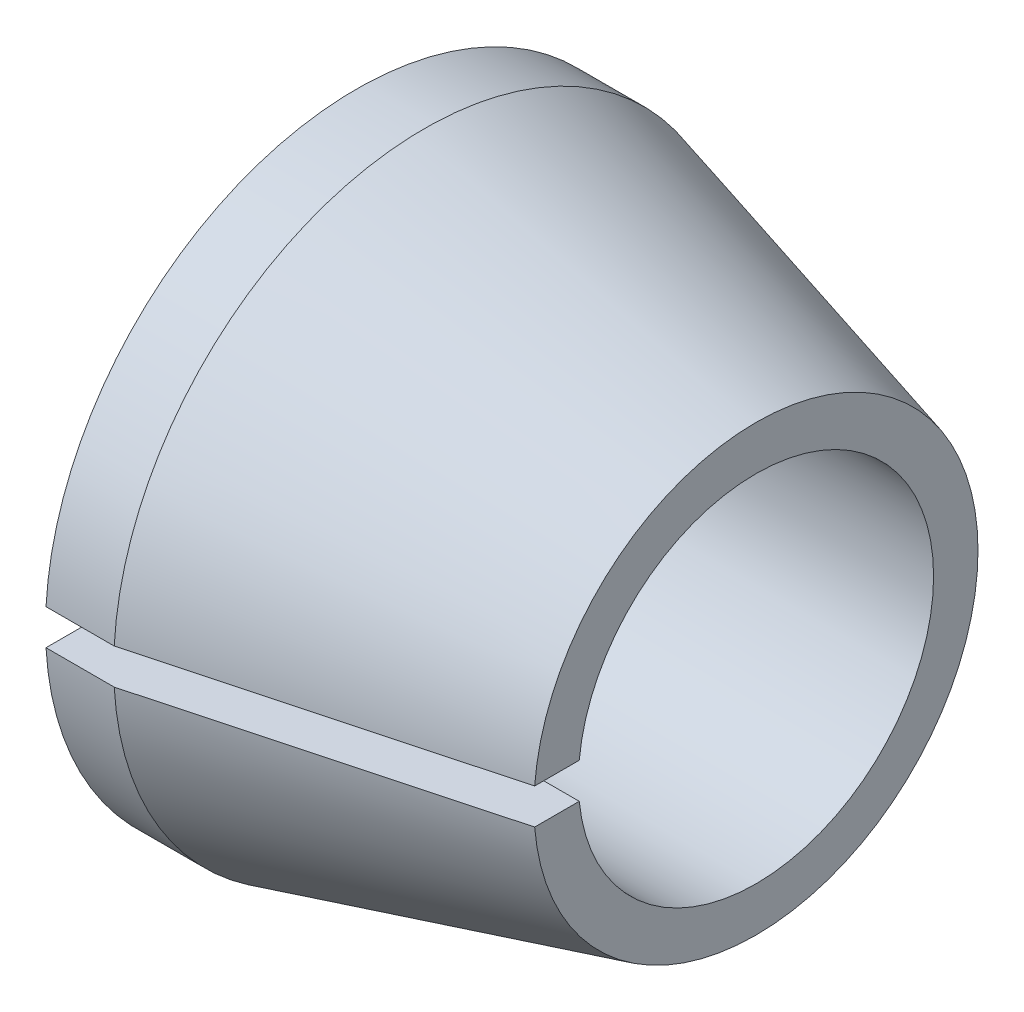
ISO-10303-21;
HEADER;
FILE_DESCRIPTION(('STEP AP214'),'2;1');
FILE_NAME('part.step','',(''),(''),'','','');
FILE_SCHEMA(('AUTOMOTIVE_DESIGN { 1 0 10303 214 1 1 1 1 }'));
ENDSEC;
DATA;
#1=APPLICATION_CONTEXT('core data for automotive mechanical design processes');
#2=APPLICATION_PROTOCOL_DEFINITION('international standard','automotive_design',2000,#1);
#3=PRODUCT_CONTEXT('',#1,'mechanical');
#4=PRODUCT('Part','Part','',(#3));
#5=PRODUCT_RELATED_PRODUCT_CATEGORY('part','',(#4));
#6=PRODUCT_DEFINITION_FORMATION('','',#4);
#7=PRODUCT_DEFINITION_CONTEXT('part definition',#1,'design');
#8=PRODUCT_DEFINITION('design','',#6,#7);
#9=PRODUCT_DEFINITION_SHAPE('','',#8);
#10=(LENGTH_UNIT() NAMED_UNIT(*) SI_UNIT(.MILLI.,.METRE.));
#11=(NAMED_UNIT(*) PLANE_ANGLE_UNIT() SI_UNIT($,.RADIAN.));
#12=(NAMED_UNIT(*) SI_UNIT($,.STERADIAN.) SOLID_ANGLE_UNIT());
#13=UNCERTAINTY_MEASURE_WITH_UNIT(LENGTH_MEASURE(1.E-05),#10,'distance_accuracy_value','');
#14=(GEOMETRIC_REPRESENTATION_CONTEXT(3) GLOBAL_UNCERTAINTY_ASSIGNED_CONTEXT((#13)) GLOBAL_UNIT_ASSIGNED_CONTEXT((#10,
#11,#12)) REPRESENTATION_CONTEXT('',''));
#15=CARTESIAN_POINT('',(0.,0.,0.));
#16=DIRECTION('',(0.,0.,1.));
#17=DIRECTION('',(1.,0.,0.));
#18=AXIS2_PLACEMENT_3D('',#15,#16,#17);
#19=CARTESIAN_POINT('',(0.,7.,0.));
#20=DIRECTION('',(1.,0.,0.));
#21=DIRECTION('',(0.,0.,-1.));
#22=AXIS2_PLACEMENT_3D('',#19,#20,#21);
#23=PLANE('',#22);
#24=DIRECTION('',(0.,0.,1.));
#25=VECTOR('',#24,1.);
#26=CARTESIAN_POINT('',(0.,0.4,10.0200502515735));
#27=LINE('',#26,#25);
#28=CARTESIAN_POINT('',(0.,0.4,3.97994974842648));
#29=VERTEX_POINT('',#28);
#30=CARTESIAN_POINT('',(0.,0.4,6.98856208386246));
#31=VERTEX_POINT('',#30);
#32=EDGE_CURVE('E76',#29,#31,#27,.T.);
#33=ORIENTED_EDGE('',*,*,#32,.T.);
#34=CARTESIAN_POINT('',(0.,0.,0.));
#35=DIRECTION('',(-1.,0.,0.));
#36=DIRECTION('',(0.,0.,1.));
#37=AXIS2_PLACEMENT_3D('',#34,#35,#36);
#38=CIRCLE('',#37,7.);
#39=CARTESIAN_POINT('',(0.,-0.4,6.98856208386246));
#40=VERTEX_POINT('',#39);
#41=EDGE_CURVE('E95',#31,#40,#38,.T.);
#42=ORIENTED_EDGE('',*,*,#41,.T.);
#43=DIRECTION('',(0.,0.,-1.));
#44=VECTOR('',#43,1.);
#45=CARTESIAN_POINT('',(0.,-0.4,10.0200502515735));
#46=LINE('',#45,#44);
#47=CARTESIAN_POINT('',(0.,-0.4,3.97994974842648));
#48=VERTEX_POINT('',#47);
#49=EDGE_CURVE('E54',#40,#48,#46,.T.);
#50=ORIENTED_EDGE('',*,*,#49,.T.);
#51=CARTESIAN_POINT('',(0.,0.,0.));
#52=DIRECTION('',(-1.,0.,0.));
#53=DIRECTION('',(0.,0.,1.));
#54=AXIS2_PLACEMENT_3D('',#51,#52,#53);
#55=CIRCLE('',#54,4.);
#56=EDGE_CURVE('E11',#29,#48,#55,.T.);
#57=ORIENTED_EDGE('',*,*,#56,.F.);
#58=EDGE_LOOP('',(#33,#42,#50,#57));
#59=FACE_BOUND('',#58,.T.);
#60=ADVANCED_FACE('F32',(#59),#23,.F.);
#61=CARTESIAN_POINT('',(0.,0.,0.));
#62=DIRECTION('',(-1.,0.,0.));
#63=DIRECTION('',(0.,0.,1.));
#64=AXIS2_PLACEMENT_3D('',#61,#62,#63);
#65=CYLINDRICAL_SURFACE('',#64,4.);
#66=DIRECTION('',(-1.,0.,0.));
#67=VECTOR('',#66,1.);
#68=CARTESIAN_POINT('',(0.,0.4,3.97994974842648));
#69=LINE('',#68,#67);
#70=CARTESIAN_POINT('',(9.,0.4,3.97994974842648));
#71=VERTEX_POINT('',#70);
#72=EDGE_CURVE('E79',#71,#29,#69,.T.);
#73=ORIENTED_EDGE('',*,*,#72,.T.);
#74=ORIENTED_EDGE('',*,*,#56,.T.);
#75=DIRECTION('',(-1.,0.,0.));
#76=VECTOR('',#75,1.);
#77=CARTESIAN_POINT('',(0.,-0.4,3.97994974842648));
#78=LINE('',#77,#76);
#79=CARTESIAN_POINT('',(9.,-0.4,3.97994974842648));
#80=VERTEX_POINT('',#79);
#81=EDGE_CURVE('E93',#48,#80,#78,.F.);
#82=ORIENTED_EDGE('',*,*,#81,.T.);
#83=CARTESIAN_POINT('',(9.,0.,0.));
#84=DIRECTION('',(-1.,0.,0.));
#85=DIRECTION('',(0.,0.,1.));
#86=AXIS2_PLACEMENT_3D('',#83,#84,#85);
#87=CIRCLE('',#86,4.);
#88=EDGE_CURVE('E39',#71,#80,#87,.T.);
#89=ORIENTED_EDGE('',*,*,#88,.F.);
#90=EDGE_LOOP('',(#73,#74,#82,#89));
#91=FACE_BOUND('',#90,.T.);
#92=ADVANCED_FACE('F90',(#91),#65,.F.);
#93=CARTESIAN_POINT('',(9.,4.,0.));
#94=DIRECTION('',(-1.,0.,0.));
#95=DIRECTION('',(0.,0.,1.));
#96=AXIS2_PLACEMENT_3D('',#93,#94,#95);
#97=PLANE('',#96);
#98=DIRECTION('',(0.,0.,-1.));
#99=VECTOR('',#98,1.);
#100=CARTESIAN_POINT('',(9.,0.4,10.0200502515735));
#101=LINE('',#100,#99);
#102=CARTESIAN_POINT('',(9.,0.4,4.98397431775085));
#103=VERTEX_POINT('',#102);
#104=EDGE_CURVE('E86',#103,#71,#101,.T.);
#105=ORIENTED_EDGE('',*,*,#104,.T.);
#106=ORIENTED_EDGE('',*,*,#88,.T.);
#107=DIRECTION('',(0.,0.,1.));
#108=VECTOR('',#107,1.);
#109=CARTESIAN_POINT('',(9.,-0.4,10.0200502515735));
#110=LINE('',#109,#108);
#111=CARTESIAN_POINT('',(9.,-0.4,4.98397431775085));
#112=VERTEX_POINT('',#111);
#113=EDGE_CURVE('E99',#80,#112,#110,.T.);
#114=ORIENTED_EDGE('',*,*,#113,.T.);
#115=CARTESIAN_POINT('',(9.,0.,0.));
#116=DIRECTION('',(-1.,0.,0.));
#117=DIRECTION('',(0.,0.,1.));
#118=AXIS2_PLACEMENT_3D('',#115,#116,#117);
#119=CIRCLE('',#118,5.);
#120=EDGE_CURVE('E189',#103,#112,#119,.T.);
#121=ORIENTED_EDGE('',*,*,#120,.F.);
#122=EDGE_LOOP('',(#105,#106,#114,#121));
#123=FACE_BOUND('',#122,.T.);
#124=ADVANCED_FACE('F131',(#123),#97,.F.);
#125=CARTESIAN_POINT('',(9.,0.,0.));
#126=DIRECTION('',(-1.,0.,0.));
#127=DIRECTION('',(0.,0.,1.));
#128=AXIS2_PLACEMENT_3D('',#125,#126,#127);
#129=CONICAL_SURFACE('',#128,5.,0.261799387799143);
#130=CARTESIAN_POINT('',(-6.5162278718255,0.4,9.14882060617355));
#131=CARTESIAN_POINT('',(-5.34516195747367,0.4,8.83473524350416));
#132=CARTESIAN_POINT('',(-4.17410375382418,0.4,8.52062115138468));
#133=CARTESIAN_POINT('',(-1.83200900851854,0.4,7.89231212338375));
#134=CARTESIAN_POINT('',(-0.660972466862835,0.4,7.57811718750062));
#135=CARTESIAN_POINT('',(2.85209460585385,0.4,6.63537622431314));
#136=CARTESIAN_POINT('',(5.19408321006079,0.4,6.00667387376323));
#137=CARTESIAN_POINT('',(8.32907861648976,0.4,5.16432776648853));
#138=CARTESIAN_POINT('',(9.12221179228603,0.4,4.95115440407249));
#139=CARTESIAN_POINT('',(10.7084268467723,0.4,4.52461707645609));
#140=CARTESIAN_POINT('',(11.5015087254649,0.4,4.31125311126516));
#141=CARTESIAN_POINT('',(13.0875980314566,0.4,3.88424781339127));
#142=CARTESIAN_POINT('',(13.8806054587401,0.4,3.67060648065017));
#143=CARTESIAN_POINT('',(15.4664837915496,0.4,3.24281727711647));
#144=CARTESIAN_POINT('',(16.2593546970526,0.4,3.02866940623898));
#145=CARTESIAN_POINT('',(17.0521262566875,0.4,2.81415369444498));
#146=B_SPLINE_CURVE_WITH_KNOTS('',3,(#130,#131,#132,#133,#134,#135,#136,#137,#138,#139,#140,
#141,#142,#143,#144,#145),.UNSPECIFIED.,.F.,.F.,(4,2,2,2,2,2,2,4),(0.,3.63736234565488,
7.27472476690024,14.5494476669136,17.0132918092633,19.4771358296572,21.9409803666187,
24.4048253165898),.UNSPECIFIED.);
#147=CARTESIAN_POINT('',(1.53589838486205,0.4,6.98856208386246));
#148=VERTEX_POINT('',#147);
#149=EDGE_CURVE('E46',#148,#103,#146,.T.);
#150=ORIENTED_EDGE('',*,*,#149,.T.);
#151=ORIENTED_EDGE('',*,*,#120,.T.);
#152=CARTESIAN_POINT('',(17.0521262566875,-0.4,2.81415369444499));
#153=CARTESIAN_POINT('',(16.3255830723887,-0.4,3.01075740479626));
#154=CARTESIAN_POINT('',(15.5989536188556,-0.4,3.20704173387838));
#155=CARTESIAN_POINT('',(14.145575094771,-0.4,3.59916666042412));
#156=CARTESIAN_POINT('',(13.4188260242386,-0.4,3.7950072579584));
#157=CARTESIAN_POINT('',(11.0916582279993,-0.4,4.42169350733463));
#158=CARTESIAN_POINT('',(9.49111070591461,-0.4,4.85206067165574));
#159=CARTESIAN_POINT('',(6.28987584172786,-0.4,5.71227489817533));
#160=CARTESIAN_POINT('',(4.68918849961481,-0.4,6.1421219603328));
#161=CARTESIAN_POINT('',(1.48773778184479,-0.4,7.00153726132646));
#162=CARTESIAN_POINT('',(-0.113025593863973,-0.4,7.43110549996973));
#163=CARTESIAN_POINT('',(-3.31459883656872,-0.4,8.29006760670641));
#164=CARTESIAN_POINT('',(-4.9154087035567,-0.4,8.7194614748296));
#165=CARTESIAN_POINT('',(-6.51622787182549,-0.4,9.14882060617355));
#166=B_SPLINE_CURVE_WITH_KNOTS('',3,(#152,#153,#154,#155,#156,#157,#158,#159,#160,#161,#162,
#163,#164,#165),.UNSPECIFIED.,.F.,.F.,(4,2,2,2,2,2,4),(0.,2.25802144979437,4.51604254011019,
9.48823642991536,14.4604307119269,19.4326284308386,24.4048252999585),.UNSPECIFIED.);
#167=CARTESIAN_POINT('',(1.53589838486205,-0.4,6.98856208386246));
#168=VERTEX_POINT('',#167);
#169=EDGE_CURVE('E96',#112,#168,#166,.T.);
#170=ORIENTED_EDGE('',*,*,#169,.T.);
#171=CARTESIAN_POINT('',(1.53589838486205,0.,0.));
#172=DIRECTION('',(-1.,0.,0.));
#173=DIRECTION('',(0.,0.,1.));
#174=AXIS2_PLACEMENT_3D('',#171,#172,#173);
#175=CIRCLE('',#174,7.);
#176=EDGE_CURVE('E186',#148,#168,#175,.T.);
#177=ORIENTED_EDGE('',*,*,#176,.F.);
#178=EDGE_LOOP('',(#150,#151,#170,#177));
#179=FACE_BOUND('',#178,.T.);
#180=ADVANCED_FACE('F127',(#179),#129,.T.);
#181=CARTESIAN_POINT('',(0.,0.,0.));
#182=DIRECTION('',(-1.,0.,0.));
#183=DIRECTION('',(0.,0.,1.));
#184=AXIS2_PLACEMENT_3D('',#181,#182,#183);
#185=CYLINDRICAL_SURFACE('',#184,7.);
#186=DIRECTION('',(-1.,0.,0.));
#187=VECTOR('',#186,1.);
#188=CARTESIAN_POINT('',(0.,0.4,6.98856208386246));
#189=LINE('',#188,#187);
#190=EDGE_CURVE('E81',#31,#148,#189,.F.);
#191=ORIENTED_EDGE('',*,*,#190,.T.);
#192=ORIENTED_EDGE('',*,*,#176,.T.);
#193=DIRECTION('',(-1.,0.,0.));
#194=VECTOR('',#193,1.);
#195=CARTESIAN_POINT('',(0.,-0.4,6.98856208386246));
#196=LINE('',#195,#194);
#197=EDGE_CURVE('E181',#168,#40,#196,.T.);
#198=ORIENTED_EDGE('',*,*,#197,.T.);
#199=ORIENTED_EDGE('',*,*,#41,.F.);
#200=EDGE_LOOP('',(#191,#192,#198,#199));
#201=FACE_BOUND('',#200,.T.);
#202=ADVANCED_FACE('F124',(#201),#185,.T.);
#203=CARTESIAN_POINT('',(9.001,-0.4,10.0200502515735));
#204=DIRECTION('',(0.,1.,0.));
#205=DIRECTION('',(0.,0.,1.));
#206=AXIS2_PLACEMENT_3D('',#203,#204,#205);
#207=PLANE('',#206);
#208=ORIENTED_EDGE('',*,*,#81,.F.);
#209=ORIENTED_EDGE('',*,*,#49,.F.);
#210=ORIENTED_EDGE('',*,*,#197,.F.);
#211=ORIENTED_EDGE('',*,*,#169,.F.);
#212=ORIENTED_EDGE('',*,*,#113,.F.);
#213=EDGE_LOOP('',(#208,#209,#210,#211,#212));
#214=FACE_BOUND('',#213,.T.);
#215=ADVANCED_FACE('F110',(#214),#207,.T.);
#216=CARTESIAN_POINT('',(9.001,0.4,10.0200502515735));
#217=DIRECTION('',(0.,-1.,0.));
#218=DIRECTION('',(0.,0.,-1.));
#219=AXIS2_PLACEMENT_3D('',#216,#217,#218);
#220=PLANE('',#219);
#221=ORIENTED_EDGE('',*,*,#149,.F.);
#222=ORIENTED_EDGE('',*,*,#190,.F.);
#223=ORIENTED_EDGE('',*,*,#32,.F.);
#224=ORIENTED_EDGE('',*,*,#72,.F.);
#225=ORIENTED_EDGE('',*,*,#104,.F.);
#226=EDGE_LOOP('',(#221,#222,#223,#224,#225));
#227=FACE_BOUND('',#226,.T.);
#228=ADVANCED_FACE('F78',(#227),#220,.T.);
#229=CLOSED_SHELL('',(#60,#92,#124,#180,#202,#215,#228));
#230=MANIFOLD_SOLID_BREP('B2',#229);
#231=ADVANCED_BREP_SHAPE_REPRESENTATION('',(#18,#230),#14);
#232=SHAPE_DEFINITION_REPRESENTATION(#9,#231);
ENDSEC;
END-ISO-10303-21;
